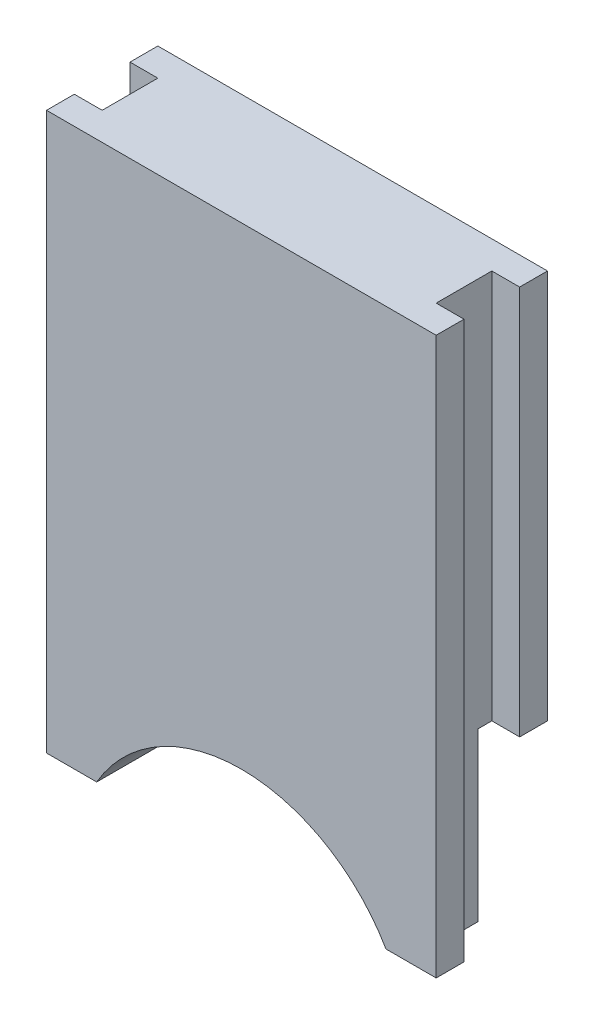
ISO-10303-21;
HEADER;
FILE_DESCRIPTION(('STEP AP214'),'2;1');
FILE_NAME('part.step','',(''),(''),'','','');
FILE_SCHEMA(('AUTOMOTIVE_DESIGN { 1 0 10303 214 1 1 1 1 }'));
ENDSEC;
DATA;
#1=APPLICATION_CONTEXT('core data for automotive mechanical design processes');
#2=APPLICATION_PROTOCOL_DEFINITION('international standard','automotive_design',2000,#1);
#3=PRODUCT_CONTEXT('',#1,'mechanical');
#4=PRODUCT('Part','Part','',(#3));
#5=PRODUCT_RELATED_PRODUCT_CATEGORY('part','',(#4));
#6=PRODUCT_DEFINITION_FORMATION('','',#4);
#7=PRODUCT_DEFINITION_CONTEXT('part definition',#1,'design');
#8=PRODUCT_DEFINITION('design','',#6,#7);
#9=PRODUCT_DEFINITION_SHAPE('','',#8);
#10=(LENGTH_UNIT() NAMED_UNIT(*) SI_UNIT(.MILLI.,.METRE.));
#11=(NAMED_UNIT(*) PLANE_ANGLE_UNIT() SI_UNIT($,.RADIAN.));
#12=(NAMED_UNIT(*) SI_UNIT($,.STERADIAN.) SOLID_ANGLE_UNIT());
#13=UNCERTAINTY_MEASURE_WITH_UNIT(LENGTH_MEASURE(1.E-05),#10,'distance_accuracy_value','');
#14=(GEOMETRIC_REPRESENTATION_CONTEXT(3) GLOBAL_UNCERTAINTY_ASSIGNED_CONTEXT((#13)) GLOBAL_UNIT_ASSIGNED_CONTEXT((#10,
#11,#12)) REPRESENTATION_CONTEXT('',''));
#15=CARTESIAN_POINT('',(0.,0.,0.));
#16=DIRECTION('',(0.,0.,1.));
#17=DIRECTION('',(1.,0.,0.));
#18=AXIS2_PLACEMENT_3D('',#15,#16,#17);
#19=CARTESIAN_POINT('',(-14.0000000000002,0.,4.));
#20=DIRECTION('',(1.,0.,0.));
#21=DIRECTION('',(0.,0.,-1.));
#22=AXIS2_PLACEMENT_3D('',#19,#20,#21);
#23=PLANE('',#22);
#24=DIRECTION('',(0.,0.,-1.));
#25=VECTOR('',#24,1.);
#26=CARTESIAN_POINT('',(-14.0000000000002,20.,4.));
#27=LINE('',#26,#25);
#28=CARTESIAN_POINT('',(-14.0000000000002,20.,4.));
#29=VERTEX_POINT('',#28);
#30=CARTESIAN_POINT('',(-14.0000000000002,20.,3.));
#31=VERTEX_POINT('',#30);
#32=EDGE_CURVE('E244',#29,#31,#27,.T.);
#33=ORIENTED_EDGE('',*,*,#32,.T.);
#34=DIRECTION('',(0.,1.,0.));
#35=VECTOR('',#34,1.);
#36=CARTESIAN_POINT('',(-14.0000000000002,0.,3.));
#37=LINE('',#36,#35);
#38=CARTESIAN_POINT('',(-14.0000000000002,0.,3.));
#39=VERTEX_POINT('',#38);
#40=EDGE_CURVE('E169',#39,#31,#37,.T.);
#41=ORIENTED_EDGE('',*,*,#40,.F.);
#42=DIRECTION('',(0.,0.,-1.));
#43=VECTOR('',#42,1.);
#44=CARTESIAN_POINT('',(-14.0000000000002,0.,4.));
#45=LINE('',#44,#43);
#46=CARTESIAN_POINT('',(-14.0000000000002,0.,4.));
#47=VERTEX_POINT('',#46);
#48=EDGE_CURVE('E166',#47,#39,#45,.T.);
#49=ORIENTED_EDGE('',*,*,#48,.F.);
#50=DIRECTION('',(0.,-1.,0.));
#51=VECTOR('',#50,1.);
#52=CARTESIAN_POINT('',(-14.0000000000002,0.,4.));
#53=LINE('',#52,#51);
#54=EDGE_CURVE('E222',#29,#47,#53,.T.);
#55=ORIENTED_EDGE('',*,*,#54,.F.);
#56=EDGE_LOOP('',(#33,#41,#49,#55));
#57=FACE_BOUND('',#56,.T.);
#58=ADVANCED_FACE('F35',(#57),#23,.F.);
#59=CARTESIAN_POINT('',(0.,0.,4.));
#60=DIRECTION('',(-1.,0.,0.));
#61=DIRECTION('',(0.,0.,1.));
#62=AXIS2_PLACEMENT_3D('',#59,#60,#61);
#63=PLANE('',#62);
#64=DIRECTION('',(0.,0.,-1.));
#65=VECTOR('',#64,1.);
#66=CARTESIAN_POINT('',(0.,0.,4.));
#67=LINE('',#66,#65);
#68=CARTESIAN_POINT('',(0.,0.,4.));
#69=VERTEX_POINT('',#68);
#70=CARTESIAN_POINT('',(0.,0.,3.));
#71=VERTEX_POINT('',#70);
#72=EDGE_CURVE('E251',#69,#71,#67,.T.);
#73=ORIENTED_EDGE('',*,*,#72,.T.);
#74=DIRECTION('',(0.,1.,0.));
#75=VECTOR('',#74,1.);
#76=CARTESIAN_POINT('',(0.,0.,3.));
#77=LINE('',#76,#75);
#78=CARTESIAN_POINT('',(0.,20.,3.));
#79=VERTEX_POINT('',#78);
#80=EDGE_CURVE('E188',#71,#79,#77,.T.);
#81=ORIENTED_EDGE('',*,*,#80,.T.);
#82=DIRECTION('',(0.,0.,-1.));
#83=VECTOR('',#82,1.);
#84=CARTESIAN_POINT('',(0.,20.,4.));
#85=LINE('',#84,#83);
#86=CARTESIAN_POINT('',(0.,20.,4.));
#87=VERTEX_POINT('',#86);
#88=EDGE_CURVE('E248',#87,#79,#85,.T.);
#89=ORIENTED_EDGE('',*,*,#88,.F.);
#90=DIRECTION('',(0.,1.,0.));
#91=VECTOR('',#90,1.);
#92=CARTESIAN_POINT('',(0.,0.,4.));
#93=LINE('',#92,#91);
#94=EDGE_CURVE('E232',#69,#87,#93,.T.);
#95=ORIENTED_EDGE('',*,*,#94,.F.);
#96=EDGE_LOOP('',(#73,#81,#89,#95));
#97=FACE_BOUND('',#96,.T.);
#98=ADVANCED_FACE('F328',(#97),#63,.F.);
#99=DIRECTION('',(0.,0.,1.));
#100=VECTOR('',#99,1.);
#101=CARTESIAN_POINT('',(-14.0000000000002,6.00000000000002,0.));
#102=LINE('',#101,#100);
#103=CARTESIAN_POINT('',(-14.0000000000002,6.00000000000002,0.));
#104=VERTEX_POINT('',#103);
#105=CARTESIAN_POINT('',(-14.0000000000002,6.00000000000002,1.));
#106=VERTEX_POINT('',#105);
#107=EDGE_CURVE('E206',#104,#106,#102,.T.);
#108=ORIENTED_EDGE('',*,*,#107,.T.);
#109=DIRECTION('',(0.,1.,0.));
#110=VECTOR('',#109,1.);
#111=CARTESIAN_POINT('',(-14.0000000000002,0.,1.));
#112=LINE('',#111,#110);
#113=CARTESIAN_POINT('',(-14.0000000000002,20.,1.));
#114=VERTEX_POINT('',#113);
#115=EDGE_CURVE('E171',#106,#114,#112,.T.);
#116=ORIENTED_EDGE('',*,*,#115,.T.);
#117=CARTESIAN_POINT('',(-14.0000000000002,20.,0.));
#118=VERTEX_POINT('',#117);
#119=EDGE_CURVE('E236',#114,#118,#27,.T.);
#120=ORIENTED_EDGE('',*,*,#119,.T.);
#121=DIRECTION('',(0.,-1.,0.));
#122=VECTOR('',#121,1.);
#123=CARTESIAN_POINT('',(-14.0000000000002,0.,0.));
#124=LINE('',#123,#122);
#125=EDGE_CURVE('E221',#118,#104,#124,.T.);
#126=ORIENTED_EDGE('',*,*,#125,.T.);
#127=EDGE_LOOP('',(#108,#116,#120,#126));
#128=FACE_BOUND('',#127,.T.);
#129=ADVANCED_FACE('F37',(#128),#23,.F.);
#130=CARTESIAN_POINT('',(-14.0000000000002,0.,4.));
#131=DIRECTION('',(0.,1.,0.));
#132=DIRECTION('',(0.,0.,1.));
#133=AXIS2_PLACEMENT_3D('',#130,#131,#132);
#134=PLANE('',#133);
#135=ORIENTED_EDGE('',*,*,#48,.T.);
#136=DIRECTION('',(1.,0.,0.));
#137=VECTOR('',#136,1.);
#138=CARTESIAN_POINT('',(-14.0000000000002,0.,3.));
#139=LINE('',#138,#137);
#140=CARTESIAN_POINT('',(-13.0000000000001,0.,3.));
#141=VERTEX_POINT('',#140);
#142=EDGE_CURVE('E151',#39,#141,#139,.T.);
#143=ORIENTED_EDGE('',*,*,#142,.T.);
#144=DIRECTION('',(0.,0.,-1.));
#145=VECTOR('',#144,1.);
#146=CARTESIAN_POINT('',(-13.0000000000001,0.,3.));
#147=LINE('',#146,#145);
#148=CARTESIAN_POINT('',(-13.0000000000001,0.,1.5));
#149=VERTEX_POINT('',#148);
#150=EDGE_CURVE('E154',#141,#149,#147,.T.);
#151=ORIENTED_EDGE('',*,*,#150,.T.);
#152=DIRECTION('',(1.,0.,0.));
#153=VECTOR('',#152,1.);
#154=CARTESIAN_POINT('',(-14.0000000000002,0.,1.5));
#155=LINE('',#154,#153);
#156=CARTESIAN_POINT('',(-12.1961524227068,0.,1.5));
#157=VERTEX_POINT('',#156);
#158=EDGE_CURVE('E212',#149,#157,#155,.T.);
#159=ORIENTED_EDGE('',*,*,#158,.T.);
#160=DIRECTION('',(0.,0.,-1.));
#161=VECTOR('',#160,1.);
#162=CARTESIAN_POINT('',(-12.1961524227068,0.,4.));
#163=LINE('',#162,#161);
#164=CARTESIAN_POINT('',(-12.1961524227068,0.,4.));
#165=VERTEX_POINT('',#164);
#166=EDGE_CURVE('E257',#165,#157,#163,.T.);
#167=ORIENTED_EDGE('',*,*,#166,.F.);
#168=DIRECTION('',(1.,0.,0.));
#169=VECTOR('',#168,1.);
#170=CARTESIAN_POINT('',(-14.0000000000002,0.,4.));
#171=LINE('',#170,#169);
#172=EDGE_CURVE('E225',#47,#165,#171,.T.);
#173=ORIENTED_EDGE('',*,*,#172,.F.);
#174=EDGE_LOOP('',(#135,#143,#151,#159,#167,#173));
#175=FACE_BOUND('',#174,.T.);
#176=ADVANCED_FACE('F164',(#175),#134,.F.);
#177=CARTESIAN_POINT('',(-7.00000000000056,-3.00000000000034,4.));
#178=DIRECTION('',(0.,0.,-1.));
#179=DIRECTION('',(-1.,0.,0.));
#180=AXIS2_PLACEMENT_3D('',#177,#178,#179);
#181=CYLINDRICAL_SURFACE('',#180,5.9999999999998);
#182=ORIENTED_EDGE('',*,*,#166,.T.);
#183=CARTESIAN_POINT('',(-7.00000000000056,-3.00000000000034,1.5));
#184=DIRECTION('',(0.,0.,1.));
#185=DIRECTION('',(1.,0.,0.));
#186=AXIS2_PLACEMENT_3D('',#183,#184,#185);
#187=CIRCLE('',#186,5.9999999999998);
#188=CARTESIAN_POINT('',(-1.80384757729435,0.,1.5));
#189=VERTEX_POINT('',#188);
#190=EDGE_CURVE('E214',#157,#189,#187,.F.);
#191=ORIENTED_EDGE('',*,*,#190,.T.);
#192=DIRECTION('',(0.,0.,-1.));
#193=VECTOR('',#192,1.);
#194=CARTESIAN_POINT('',(-1.80384757729435,0.,4.));
#195=LINE('',#194,#193);
#196=CARTESIAN_POINT('',(-1.80384757729435,0.,4.));
#197=VERTEX_POINT('',#196);
#198=EDGE_CURVE('E254',#197,#189,#195,.T.);
#199=ORIENTED_EDGE('',*,*,#198,.F.);
#200=CARTESIAN_POINT('',(-7.00000000000056,-3.00000000000034,4.));
#201=DIRECTION('',(0.,0.,-1.));
#202=DIRECTION('',(1.,0.,0.));
#203=AXIS2_PLACEMENT_3D('',#200,#201,#202);
#204=CIRCLE('',#203,5.9999999999998);
#205=EDGE_CURVE('E228',#165,#197,#204,.T.);
#206=ORIENTED_EDGE('',*,*,#205,.F.);
#207=EDGE_LOOP('',(#182,#191,#199,#206));
#208=FACE_BOUND('',#207,.T.);
#209=ADVANCED_FACE('F310',(#208),#181,.F.);
#210=CARTESIAN_POINT('',(-1.80384757729435,0.,4.));
#211=DIRECTION('',(0.,1.,0.));
#212=DIRECTION('',(0.,0.,1.));
#213=AXIS2_PLACEMENT_3D('',#210,#211,#212);
#214=PLANE('',#213);
#215=DIRECTION('',(0.,0.,1.));
#216=VECTOR('',#215,1.);
#217=CARTESIAN_POINT('',(-1.00000000000012,0.,3.));
#218=LINE('',#217,#216);
#219=CARTESIAN_POINT('',(-1.00000000000012,0.,1.5));
#220=VERTEX_POINT('',#219);
#221=CARTESIAN_POINT('',(-1.00000000000012,0.,3.));
#222=VERTEX_POINT('',#221);
#223=EDGE_CURVE('E181',#220,#222,#218,.T.);
#224=ORIENTED_EDGE('',*,*,#223,.T.);
#225=DIRECTION('',(1.,0.,0.));
#226=VECTOR('',#225,1.);
#227=CARTESIAN_POINT('',(0.,0.,3.));
#228=LINE('',#227,#226);
#229=EDGE_CURVE('E184',#222,#71,#228,.T.);
#230=ORIENTED_EDGE('',*,*,#229,.T.);
#231=ORIENTED_EDGE('',*,*,#72,.F.);
#232=DIRECTION('',(1.,0.,0.));
#233=VECTOR('',#232,1.);
#234=CARTESIAN_POINT('',(-1.80384757729435,0.,4.));
#235=LINE('',#234,#233);
#236=EDGE_CURVE('E230',#197,#69,#235,.T.);
#237=ORIENTED_EDGE('',*,*,#236,.F.);
#238=ORIENTED_EDGE('',*,*,#198,.T.);
#239=EDGE_CURVE('E215',#189,#220,#155,.T.);
#240=ORIENTED_EDGE('',*,*,#239,.T.);
#241=EDGE_LOOP('',(#224,#230,#231,#237,#238,#240));
#242=FACE_BOUND('',#241,.T.);
#243=ADVANCED_FACE('F301',(#242),#214,.F.);
#244=CARTESIAN_POINT('',(0.,20.,1.));
#245=VERTEX_POINT('',#244);
#246=CARTESIAN_POINT('',(0.,20.,0.));
#247=VERTEX_POINT('',#246);
#248=EDGE_CURVE('E247',#245,#247,#85,.T.);
#249=ORIENTED_EDGE('',*,*,#248,.F.);
#250=DIRECTION('',(0.,1.,0.));
#251=VECTOR('',#250,1.);
#252=CARTESIAN_POINT('',(0.,0.,1.));
#253=LINE('',#252,#251);
#254=CARTESIAN_POINT('',(0.,6.00000000000002,1.));
#255=VERTEX_POINT('',#254);
#256=EDGE_CURVE('E187',#255,#245,#253,.T.);
#257=ORIENTED_EDGE('',*,*,#256,.F.);
#258=DIRECTION('',(0.,0.,1.));
#259=VECTOR('',#258,1.);
#260=CARTESIAN_POINT('',(0.,6.00000000000002,0.));
#261=LINE('',#260,#259);
#262=CARTESIAN_POINT('',(0.,6.00000000000002,0.));
#263=VERTEX_POINT('',#262);
#264=EDGE_CURVE('E205',#263,#255,#261,.T.);
#265=ORIENTED_EDGE('',*,*,#264,.F.);
#266=DIRECTION('',(0.,1.,0.));
#267=VECTOR('',#266,1.);
#268=CARTESIAN_POINT('',(0.,0.,0.));
#269=LINE('',#268,#267);
#270=EDGE_CURVE('E239',#263,#247,#269,.T.);
#271=ORIENTED_EDGE('',*,*,#270,.T.);
#272=EDGE_LOOP('',(#249,#257,#265,#271));
#273=FACE_BOUND('',#272,.T.);
#274=ADVANCED_FACE('F289',(#273),#63,.F.);
#275=CARTESIAN_POINT('',(-14.0000000000002,20.,4.));
#276=DIRECTION('',(0.,-1.,0.));
#277=DIRECTION('',(0.,0.,-1.));
#278=AXIS2_PLACEMENT_3D('',#275,#276,#277);
#279=PLANE('',#278);
#280=DIRECTION('',(0.,0.,1.));
#281=VECTOR('',#280,1.);
#282=CARTESIAN_POINT('',(-13.0000000000001,20.,4.));
#283=LINE('',#282,#281);
#284=CARTESIAN_POINT('',(-13.0000000000001,20.,1.));
#285=VERTEX_POINT('',#284);
#286=CARTESIAN_POINT('',(-13.0000000000001,20.,3.));
#287=VERTEX_POINT('',#286);
#288=EDGE_CURVE('E176',#285,#287,#283,.T.);
#289=ORIENTED_EDGE('',*,*,#288,.T.);
#290=DIRECTION('',(-1.,0.,0.));
#291=VECTOR('',#290,1.);
#292=CARTESIAN_POINT('',(-14.0000000000002,20.,3.));
#293=LINE('',#292,#291);
#294=EDGE_CURVE('E11',#287,#31,#293,.T.);
#295=ORIENTED_EDGE('',*,*,#294,.T.);
#296=ORIENTED_EDGE('',*,*,#32,.F.);
#297=DIRECTION('',(-1.,0.,0.));
#298=VECTOR('',#297,1.);
#299=CARTESIAN_POINT('',(-14.0000000000002,20.,4.));
#300=LINE('',#299,#298);
#301=EDGE_CURVE('E234',#87,#29,#300,.T.);
#302=ORIENTED_EDGE('',*,*,#301,.F.);
#303=ORIENTED_EDGE('',*,*,#88,.T.);
#304=DIRECTION('',(-1.,0.,0.));
#305=VECTOR('',#304,1.);
#306=CARTESIAN_POINT('',(-14.0000000000002,20.,3.));
#307=LINE('',#306,#305);
#308=CARTESIAN_POINT('',(-1.00000000000012,20.,3.));
#309=VERTEX_POINT('',#308);
#310=EDGE_CURVE('E267',#79,#309,#307,.T.);
#311=ORIENTED_EDGE('',*,*,#310,.T.);
#312=DIRECTION('',(0.,0.,-1.));
#313=VECTOR('',#312,1.);
#314=CARTESIAN_POINT('',(-1.00000000000012,20.,4.));
#315=LINE('',#314,#313);
#316=CARTESIAN_POINT('',(-1.00000000000012,20.,1.));
#317=VERTEX_POINT('',#316);
#318=EDGE_CURVE('E202',#309,#317,#315,.T.);
#319=ORIENTED_EDGE('',*,*,#318,.T.);
#320=DIRECTION('',(1.,0.,0.));
#321=VECTOR('',#320,1.);
#322=CARTESIAN_POINT('',(-14.0000000000002,20.,1.));
#323=LINE('',#322,#321);
#324=EDGE_CURVE('E191',#317,#245,#323,.T.);
#325=ORIENTED_EDGE('',*,*,#324,.T.);
#326=ORIENTED_EDGE('',*,*,#248,.T.);
#327=DIRECTION('',(-1.,0.,0.));
#328=VECTOR('',#327,1.);
#329=CARTESIAN_POINT('',(-14.0000000000002,20.,0.));
#330=LINE('',#329,#328);
#331=EDGE_CURVE('E226',#247,#118,#330,.T.);
#332=ORIENTED_EDGE('',*,*,#331,.T.);
#333=ORIENTED_EDGE('',*,*,#119,.F.);
#334=DIRECTION('',(1.,0.,0.));
#335=VECTOR('',#334,1.);
#336=CARTESIAN_POINT('',(-14.0000000000002,20.,1.));
#337=LINE('',#336,#335);
#338=EDGE_CURVE('E178',#114,#285,#337,.T.);
#339=ORIENTED_EDGE('',*,*,#338,.T.);
#340=EDGE_LOOP('',(#289,#295,#296,#302,#303,#311,#319,#325,#326,#332,#333,#339));
#341=FACE_BOUND('',#340,.T.);
#342=ADVANCED_FACE('F292',(#341),#279,.F.);
#343=CARTESIAN_POINT('',(-7.00000000000056,-3.00000000000034,4.));
#344=DIRECTION('',(0.,0.,1.));
#345=DIRECTION('',(1.,0.,0.));
#346=AXIS2_PLACEMENT_3D('',#343,#344,#345);
#347=PLANE('',#346);
#348=ORIENTED_EDGE('',*,*,#54,.T.);
#349=ORIENTED_EDGE('',*,*,#172,.T.);
#350=ORIENTED_EDGE('',*,*,#205,.T.);
#351=ORIENTED_EDGE('',*,*,#236,.T.);
#352=ORIENTED_EDGE('',*,*,#94,.T.);
#353=ORIENTED_EDGE('',*,*,#301,.T.);
#354=EDGE_LOOP('',(#348,#349,#350,#351,#352,#353));
#355=FACE_BOUND('',#354,.T.);
#356=ADVANCED_FACE('F313',(#355),#347,.T.);
#357=CARTESIAN_POINT('',(-7.00000000000056,-3.00000000000034,0.));
#358=DIRECTION('',(0.,0.,1.));
#359=DIRECTION('',(1.,0.,0.));
#360=AXIS2_PLACEMENT_3D('',#357,#358,#359);
#361=PLANE('',#360);
#362=ORIENTED_EDGE('',*,*,#270,.F.);
#363=DIRECTION('',(1.,0.,0.));
#364=VECTOR('',#363,1.);
#365=CARTESIAN_POINT('',(-14.0000000000002,6.00000000000002,0.));
#366=LINE('',#365,#364);
#367=EDGE_CURVE('E209',#104,#263,#366,.T.);
#368=ORIENTED_EDGE('',*,*,#367,.F.);
#369=ORIENTED_EDGE('',*,*,#125,.F.);
#370=ORIENTED_EDGE('',*,*,#331,.F.);
#371=EDGE_LOOP('',(#362,#368,#369,#370));
#372=FACE_BOUND('',#371,.T.);
#373=ADVANCED_FACE('F284',(#372),#361,.F.);
#374=CARTESIAN_POINT('',(-14.0000000000002,0.,1.5));
#375=DIRECTION('',(0.,0.,1.));
#376=DIRECTION('',(1.,0.,0.));
#377=AXIS2_PLACEMENT_3D('',#374,#375,#376);
#378=PLANE('',#377);
#379=ORIENTED_EDGE('',*,*,#158,.F.);
#380=DIRECTION('',(0.,1.,0.));
#381=VECTOR('',#380,1.);
#382=CARTESIAN_POINT('',(-13.0000000000001,0.,1.5));
#383=LINE('',#382,#381);
#384=CARTESIAN_POINT('',(-13.0000000000001,6.00000000000002,1.5));
#385=VERTEX_POINT('',#384);
#386=EDGE_CURVE('E159',#149,#385,#383,.T.);
#387=ORIENTED_EDGE('',*,*,#386,.T.);
#388=DIRECTION('',(1.,0.,0.));
#389=VECTOR('',#388,1.);
#390=CARTESIAN_POINT('',(-14.0000000000002,6.00000000000002,1.5));
#391=LINE('',#390,#389);
#392=CARTESIAN_POINT('',(-1.00000000000012,6.00000000000002,1.5));
#393=VERTEX_POINT('',#392);
#394=EDGE_CURVE('E216',#385,#393,#391,.T.);
#395=ORIENTED_EDGE('',*,*,#394,.T.);
#396=DIRECTION('',(0.,-1.,0.));
#397=VECTOR('',#396,1.);
#398=CARTESIAN_POINT('',(-1.00000000000012,0.,1.5));
#399=LINE('',#398,#397);
#400=EDGE_CURVE('E199',#393,#220,#399,.T.);
#401=ORIENTED_EDGE('',*,*,#400,.T.);
#402=ORIENTED_EDGE('',*,*,#239,.F.);
#403=ORIENTED_EDGE('',*,*,#190,.F.);
#404=EDGE_LOOP('',(#379,#387,#395,#401,#402,#403));
#405=FACE_BOUND('',#404,.T.);
#406=ADVANCED_FACE('F304',(#405),#378,.F.);
#407=CARTESIAN_POINT('',(-14.0000000000002,6.00000000000002,0.));
#408=DIRECTION('',(0.,1.,0.));
#409=DIRECTION('',(0.,0.,1.));
#410=AXIS2_PLACEMENT_3D('',#407,#408,#409);
#411=PLANE('',#410);
#412=DIRECTION('',(0.,0.,-1.));
#413=VECTOR('',#412,1.);
#414=CARTESIAN_POINT('',(-13.0000000000001,6.00000000000002,0.));
#415=LINE('',#414,#413);
#416=CARTESIAN_POINT('',(-13.0000000000001,6.00000000000002,1.));
#417=VERTEX_POINT('',#416);
#418=EDGE_CURVE('E270',#385,#417,#415,.T.);
#419=ORIENTED_EDGE('',*,*,#418,.T.);
#420=DIRECTION('',(-1.,0.,0.));
#421=VECTOR('',#420,1.);
#422=CARTESIAN_POINT('',(-14.0000000000002,6.00000000000002,1.));
#423=LINE('',#422,#421);
#424=EDGE_CURVE('E43',#417,#106,#423,.T.);
#425=ORIENTED_EDGE('',*,*,#424,.T.);
#426=ORIENTED_EDGE('',*,*,#107,.F.);
#427=ORIENTED_EDGE('',*,*,#367,.T.);
#428=ORIENTED_EDGE('',*,*,#264,.T.);
#429=DIRECTION('',(-1.,0.,0.));
#430=VECTOR('',#429,1.);
#431=CARTESIAN_POINT('',(-14.0000000000002,6.00000000000002,1.));
#432=LINE('',#431,#430);
#433=CARTESIAN_POINT('',(-1.00000000000012,6.00000000000002,1.));
#434=VERTEX_POINT('',#433);
#435=EDGE_CURVE('E261',#255,#434,#432,.T.);
#436=ORIENTED_EDGE('',*,*,#435,.T.);
#437=DIRECTION('',(0.,0.,1.));
#438=VECTOR('',#437,1.);
#439=CARTESIAN_POINT('',(-1.00000000000012,6.00000000000002,0.));
#440=LINE('',#439,#438);
#441=EDGE_CURVE('E264',#434,#393,#440,.T.);
#442=ORIENTED_EDGE('',*,*,#441,.T.);
#443=ORIENTED_EDGE('',*,*,#394,.F.);
#444=EDGE_LOOP('',(#419,#425,#426,#427,#428,#436,#442,#443));
#445=FACE_BOUND('',#444,.T.);
#446=ADVANCED_FACE('F274',(#445),#411,.F.);
#447=CARTESIAN_POINT('',(0.,0.,3.));
#448=DIRECTION('',(0.,0.,1.));
#449=DIRECTION('',(1.,0.,0.));
#450=AXIS2_PLACEMENT_3D('',#447,#448,#449);
#451=PLANE('',#450);
#452=ORIENTED_EDGE('',*,*,#80,.F.);
#453=ORIENTED_EDGE('',*,*,#229,.F.);
#454=DIRECTION('',(0.,1.,0.));
#455=VECTOR('',#454,1.);
#456=CARTESIAN_POINT('',(-1.00000000000012,0.,3.));
#457=LINE('',#456,#455);
#458=EDGE_CURVE('E192',#222,#309,#457,.T.);
#459=ORIENTED_EDGE('',*,*,#458,.T.);
#460=ORIENTED_EDGE('',*,*,#310,.F.);
#461=EDGE_LOOP('',(#452,#453,#459,#460));
#462=FACE_BOUND('',#461,.T.);
#463=ADVANCED_FACE('F297',(#462),#451,.F.);
#464=CARTESIAN_POINT('',(-1.00000000000012,0.,3.));
#465=DIRECTION('',(-1.,0.,0.));
#466=DIRECTION('',(0.,0.,1.));
#467=AXIS2_PLACEMENT_3D('',#464,#465,#466);
#468=PLANE('',#467);
#469=ORIENTED_EDGE('',*,*,#458,.F.);
#470=ORIENTED_EDGE('',*,*,#223,.F.);
#471=ORIENTED_EDGE('',*,*,#400,.F.);
#472=ORIENTED_EDGE('',*,*,#441,.F.);
#473=DIRECTION('',(0.,1.,0.));
#474=VECTOR('',#473,1.);
#475=CARTESIAN_POINT('',(-1.00000000000012,0.,1.));
#476=LINE('',#475,#474);
#477=EDGE_CURVE('E58',#434,#317,#476,.T.);
#478=ORIENTED_EDGE('',*,*,#477,.T.);
#479=ORIENTED_EDGE('',*,*,#318,.F.);
#480=EDGE_LOOP('',(#469,#470,#471,#472,#478,#479));
#481=FACE_BOUND('',#480,.T.);
#482=ADVANCED_FACE('F294',(#481),#468,.F.);
#483=CARTESIAN_POINT('',(0.,0.,1.));
#484=DIRECTION('',(0.,0.,-1.));
#485=DIRECTION('',(-1.,0.,0.));
#486=AXIS2_PLACEMENT_3D('',#483,#484,#485);
#487=PLANE('',#486);
#488=ORIENTED_EDGE('',*,*,#477,.F.);
#489=ORIENTED_EDGE('',*,*,#435,.F.);
#490=ORIENTED_EDGE('',*,*,#256,.T.);
#491=ORIENTED_EDGE('',*,*,#324,.F.);
#492=EDGE_LOOP('',(#488,#489,#490,#491));
#493=FACE_BOUND('',#492,.T.);
#494=ADVANCED_FACE('F290',(#493),#487,.F.);
#495=CARTESIAN_POINT('',(-14.0000000000002,0.,3.));
#496=DIRECTION('',(0.,0.,1.));
#497=DIRECTION('',(1.,0.,0.));
#498=AXIS2_PLACEMENT_3D('',#495,#496,#497);
#499=PLANE('',#498);
#500=DIRECTION('',(0.,1.,0.));
#501=VECTOR('',#500,1.);
#502=CARTESIAN_POINT('',(-13.0000000000001,0.,3.));
#503=LINE('',#502,#501);
#504=EDGE_CURVE('E147',#141,#287,#503,.T.);
#505=ORIENTED_EDGE('',*,*,#504,.F.);
#506=ORIENTED_EDGE('',*,*,#142,.F.);
#507=ORIENTED_EDGE('',*,*,#40,.T.);
#508=ORIENTED_EDGE('',*,*,#294,.F.);
#509=EDGE_LOOP('',(#505,#506,#507,#508));
#510=FACE_BOUND('',#509,.T.);
#511=ADVANCED_FACE('F149',(#510),#499,.F.);
#512=CARTESIAN_POINT('',(-14.0000000000002,0.,1.));
#513=DIRECTION('',(0.,0.,-1.));
#514=DIRECTION('',(-1.,0.,0.));
#515=AXIS2_PLACEMENT_3D('',#512,#513,#514);
#516=PLANE('',#515);
#517=ORIENTED_EDGE('',*,*,#115,.F.);
#518=ORIENTED_EDGE('',*,*,#424,.F.);
#519=DIRECTION('',(0.,1.,0.));
#520=VECTOR('',#519,1.);
#521=CARTESIAN_POINT('',(-13.0000000000001,0.,1.));
#522=LINE('',#521,#520);
#523=EDGE_CURVE('E50',#417,#285,#522,.T.);
#524=ORIENTED_EDGE('',*,*,#523,.T.);
#525=ORIENTED_EDGE('',*,*,#338,.F.);
#526=EDGE_LOOP('',(#517,#518,#524,#525));
#527=FACE_BOUND('',#526,.T.);
#528=ADVANCED_FACE('F318',(#527),#516,.F.);
#529=CARTESIAN_POINT('',(-13.0000000000001,0.,3.));
#530=DIRECTION('',(1.,0.,0.));
#531=DIRECTION('',(0.,0.,-1.));
#532=AXIS2_PLACEMENT_3D('',#529,#530,#531);
#533=PLANE('',#532);
#534=ORIENTED_EDGE('',*,*,#523,.F.);
#535=ORIENTED_EDGE('',*,*,#418,.F.);
#536=ORIENTED_EDGE('',*,*,#386,.F.);
#537=ORIENTED_EDGE('',*,*,#150,.F.);
#538=ORIENTED_EDGE('',*,*,#504,.T.);
#539=ORIENTED_EDGE('',*,*,#288,.F.);
#540=EDGE_LOOP('',(#534,#535,#536,#537,#538,#539));
#541=FACE_BOUND('',#540,.T.);
#542=ADVANCED_FACE('F157',(#541),#533,.F.);
#543=CLOSED_SHELL('',(#58,#98,#129,#176,#209,#243,#274,#342,#356,#373,#406,#446,#463,#482,#494,
#511,#528,#542));
#544=MANIFOLD_SOLID_BREP('B2',#543);
#545=ADVANCED_BREP_SHAPE_REPRESENTATION('',(#18,#544),#14);
#546=SHAPE_DEFINITION_REPRESENTATION(#9,#545);
ENDSEC;
END-ISO-10303-21;
